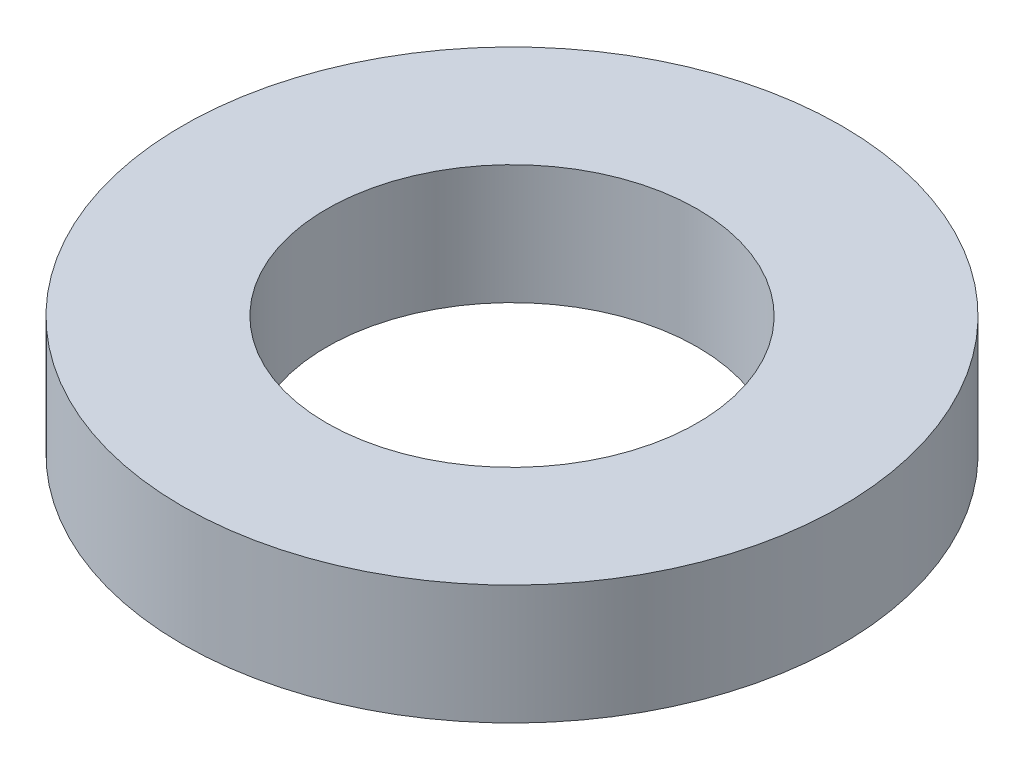
ISO-10303-21;
HEADER;
FILE_DESCRIPTION(('STEP AP214'),'2;1');
FILE_NAME('part.step','',(''),(''),'','','');
FILE_SCHEMA(('AUTOMOTIVE_DESIGN { 1 0 10303 214 1 1 1 1 }'));
ENDSEC;
DATA;
#1=APPLICATION_CONTEXT('core data for automotive mechanical design processes');
#2=APPLICATION_PROTOCOL_DEFINITION('international standard','automotive_design',2000,#1);
#3=PRODUCT_CONTEXT('',#1,'mechanical');
#4=PRODUCT('Part','Part','',(#3));
#5=PRODUCT_RELATED_PRODUCT_CATEGORY('part','',(#4));
#6=PRODUCT_DEFINITION_FORMATION('','',#4);
#7=PRODUCT_DEFINITION_CONTEXT('part definition',#1,'design');
#8=PRODUCT_DEFINITION('design','',#6,#7);
#9=PRODUCT_DEFINITION_SHAPE('','',#8);
#10=(LENGTH_UNIT() NAMED_UNIT(*) SI_UNIT(.MILLI.,.METRE.));
#11=(NAMED_UNIT(*) PLANE_ANGLE_UNIT() SI_UNIT($,.RADIAN.));
#12=(NAMED_UNIT(*) SI_UNIT($,.STERADIAN.) SOLID_ANGLE_UNIT());
#13=UNCERTAINTY_MEASURE_WITH_UNIT(LENGTH_MEASURE(1.E-05),#10,'distance_accuracy_value','');
#14=(GEOMETRIC_REPRESENTATION_CONTEXT(3) GLOBAL_UNCERTAINTY_ASSIGNED_CONTEXT((#13)) GLOBAL_UNIT_ASSIGNED_CONTEXT((#10,
#11,#12)) REPRESENTATION_CONTEXT('',''));
#15=CARTESIAN_POINT('',(0.,0.,0.));
#16=DIRECTION('',(0.,0.,1.));
#17=DIRECTION('',(1.,0.,0.));
#18=AXIS2_PLACEMENT_3D('',#15,#16,#17);
#19=CARTESIAN_POINT('',(0.,29.,0.));
#20=DIRECTION('',(0.,-1.,0.));
#21=DIRECTION('',(0.,0.,-1.));
#22=AXIS2_PLACEMENT_3D('',#19,#20,#21);
#23=CYLINDRICAL_SURFACE('',#22,80.);
#24=CARTESIAN_POINT('',(0.,29.,0.));
#25=DIRECTION('',(0.,1.,0.));
#26=DIRECTION('',(0.,0.,1.));
#27=AXIS2_PLACEMENT_3D('',#24,#25,#26);
#28=CIRCLE('',#27,80.);
#29=CARTESIAN_POINT('',(0.,29.,-80.));
#30=VERTEX_POINT('',#29);
#31=EDGE_CURVE('E10',#30,#30,#28,.T.);
#32=CARTESIAN_POINT('',(0.,0.,0.));
#33=DIRECTION('',(0.,1.,0.));
#34=DIRECTION('',(0.,0.,1.));
#35=AXIS2_PLACEMENT_3D('',#32,#33,#34);
#36=CIRCLE('',#35,80.);
#37=CARTESIAN_POINT('',(0.,0.,-80.));
#38=VERTEX_POINT('',#37);
#39=EDGE_CURVE('E37',#38,#38,#36,.T.);
#40=CARTESIAN_POINT('',(0.,29.,-80.));
#41=CARTESIAN_POINT('',(0.,28.6979166666667,-80.));
#42=CARTESIAN_POINT('',(0.,28.3958333333333,-80.));
#43=CARTESIAN_POINT('',(0.,27.7916666666667,-80.));
#44=CARTESIAN_POINT('',(0.,27.4895833333333,-80.));
#45=CARTESIAN_POINT('',(0.,26.8854166666667,-80.));
#46=CARTESIAN_POINT('',(0.,26.5833333333333,-80.));
#47=CARTESIAN_POINT('',(0.,25.9791666666667,-80.));
#48=CARTESIAN_POINT('',(0.,25.6770833333333,-80.));
#49=CARTESIAN_POINT('',(0.,25.0729166666667,-80.));
#50=CARTESIAN_POINT('',(0.,24.7708333333333,-80.));
#51=CARTESIAN_POINT('',(0.,24.1666666666667,-80.));
#52=CARTESIAN_POINT('',(0.,23.8645833333333,-80.));
#53=CARTESIAN_POINT('',(0.,23.2604166666667,-80.));
#54=CARTESIAN_POINT('',(0.,22.9583333333333,-80.));
#55=CARTESIAN_POINT('',(0.,22.3541666666667,-80.));
#56=CARTESIAN_POINT('',(0.,22.0520833333333,-80.));
#57=CARTESIAN_POINT('',(0.,21.4479166666667,-80.));
#58=CARTESIAN_POINT('',(0.,21.1458333333333,-80.));
#59=CARTESIAN_POINT('',(0.,20.5416666666667,-80.));
#60=CARTESIAN_POINT('',(0.,20.2395833333333,-80.));
#61=CARTESIAN_POINT('',(0.,19.6354166666667,-80.));
#62=CARTESIAN_POINT('',(0.,19.3333333333333,-80.));
#63=CARTESIAN_POINT('',(0.,18.7291666666667,-80.));
#64=CARTESIAN_POINT('',(0.,18.4270833333333,-80.));
#65=CARTESIAN_POINT('',(0.,17.8229166666667,-80.));
#66=CARTESIAN_POINT('',(0.,17.5208333333333,-80.));
#67=CARTESIAN_POINT('',(0.,16.9166666666667,-80.));
#68=CARTESIAN_POINT('',(0.,16.6145833333333,-80.));
#69=CARTESIAN_POINT('',(0.,16.0104166666667,-80.));
#70=CARTESIAN_POINT('',(0.,15.7083333333333,-80.));
#71=CARTESIAN_POINT('',(0.,15.1041666666667,-80.));
#72=CARTESIAN_POINT('',(0.,14.8020833333333,-80.));
#73=CARTESIAN_POINT('',(0.,14.1979166666667,-80.));
#74=CARTESIAN_POINT('',(0.,13.8958333333333,-80.));
#75=CARTESIAN_POINT('',(0.,13.2916666666667,-80.));
#76=CARTESIAN_POINT('',(0.,12.9895833333333,-80.));
#77=CARTESIAN_POINT('',(0.,12.3854166666667,-80.));
#78=CARTESIAN_POINT('',(0.,12.0833333333333,-80.));
#79=CARTESIAN_POINT('',(0.,11.4791666666667,-80.));
#80=CARTESIAN_POINT('',(0.,11.1770833333333,-80.));
#81=CARTESIAN_POINT('',(0.,10.5729166666667,-80.));
#82=CARTESIAN_POINT('',(0.,10.2708333333333,-80.));
#83=CARTESIAN_POINT('',(0.,9.66666666666667,-80.));
#84=CARTESIAN_POINT('',(0.,9.36458333333333,-80.));
#85=CARTESIAN_POINT('',(0.,8.76041666666667,-80.));
#86=CARTESIAN_POINT('',(0.,8.45833333333333,-80.));
#87=CARTESIAN_POINT('',(0.,7.85416666666667,-80.));
#88=CARTESIAN_POINT('',(0.,7.55208333333333,-80.));
#89=CARTESIAN_POINT('',(0.,6.94791666666667,-80.));
#90=CARTESIAN_POINT('',(0.,6.64583333333333,-80.));
#91=CARTESIAN_POINT('',(0.,6.04166666666667,-80.));
#92=CARTESIAN_POINT('',(0.,5.73958333333333,-80.));
#93=CARTESIAN_POINT('',(0.,5.13541666666667,-80.));
#94=CARTESIAN_POINT('',(0.,4.83333333333333,-80.));
#95=CARTESIAN_POINT('',(0.,4.22916666666667,-80.));
#96=CARTESIAN_POINT('',(0.,3.92708333333333,-80.));
#97=CARTESIAN_POINT('',(0.,3.32291666666667,-80.));
#98=CARTESIAN_POINT('',(0.,3.02083333333333,-80.));
#99=CARTESIAN_POINT('',(0.,2.41666666666667,-80.));
#100=CARTESIAN_POINT('',(0.,2.11458333333333,-80.));
#101=CARTESIAN_POINT('',(0.,1.51041666666667,-80.));
#102=CARTESIAN_POINT('',(0.,1.20833333333333,-80.));
#103=CARTESIAN_POINT('',(0.,0.604166666666667,-80.));
#104=CARTESIAN_POINT('',(0.,0.302083333333333,-80.));
#105=CARTESIAN_POINT('',(0.,0.,-80.));
#106=B_SPLINE_CURVE_WITH_KNOTS('',3,(#40,#41,#42,#43,#44,#45,#46,#47,#48,#49,#50,#51,#52,#53,
#54,#55,#56,#57,#58,#59,#60,#61,#62,#63,#64,#65,#66,#67,#68,#69,#70,#71,#72,#73,#74,#75,#76,#77,
#78,#79,#80,#81,#82,#83,#84,#85,#86,#87,#88,#89,#90,#91,#92,#93,#94,#95,#96,#97,#98,#99,#100,
#101,#102,#103,#104,#105),.UNSPECIFIED.,.F.,.F.,(4,2,2,2,2,2,2,2,2,2,2,2,2,2,2,2,2,2,2,2,2,2,2,
2,2,2,2,2,2,2,2,2,4),(0.,0.906249999999997,1.8125,2.71875,3.625,4.53125,5.4375,6.34375,7.25,
8.15625,9.0625,9.96875,10.875,11.78125,12.6875,13.59375,14.5,15.40625,16.3125,17.21875,18.125,
19.03125,19.9375,20.84375,21.75,22.65625,23.5625,24.46875,25.375,26.28125,27.1875,28.09375,29.),.UNSPECIFIED.);
#107=EDGE_CURVE('BSEAM40',#30,#38,#106,.T.);
#108=ORIENTED_EDGE('',*,*,#31,.F.);
#109=ORIENTED_EDGE('',*,*,#39,.T.);
#110=ORIENTED_EDGE('',*,*,#107,.T.);
#111=ORIENTED_EDGE('',*,*,#107,.F.);
#112=EDGE_LOOP('',(#108,#110,#109,#111));
#113=FACE_BOUND('',#112,.T.);
#114=ADVANCED_FACE('F40',(#113),#23,.T.);
#115=CARTESIAN_POINT('',(0.,29.,0.));
#116=DIRECTION('',(0.,1.,0.));
#117=DIRECTION('',(0.,0.,1.));
#118=AXIS2_PLACEMENT_3D('',#115,#116,#117);
#119=PLANE('',#118);
#120=CARTESIAN_POINT('',(0.,29.,0.));
#121=DIRECTION('',(0.,1.,0.));
#122=DIRECTION('',(0.,0.,1.));
#123=AXIS2_PLACEMENT_3D('',#120,#121,#122);
#124=CIRCLE('',#123,45.);
#125=CARTESIAN_POINT('',(0.,29.,-45.));
#126=VERTEX_POINT('',#125);
#127=EDGE_CURVE('E50',#126,#126,#124,.T.);
#128=ORIENTED_EDGE('',*,*,#127,.F.);
#129=EDGE_LOOP('',(#128));
#130=FACE_BOUND('',#129,.T.);
#131=ORIENTED_EDGE('',*,*,#31,.T.);
#132=EDGE_LOOP('',(#131));
#133=FACE_BOUND('',#132,.T.);
#134=ADVANCED_FACE('F59',(#130,#133),#119,.T.);
#135=CARTESIAN_POINT('',(0.,0.,0.));
#136=DIRECTION('',(0.,1.,0.));
#137=DIRECTION('',(0.,0.,1.));
#138=AXIS2_PLACEMENT_3D('',#135,#136,#137);
#139=PLANE('',#138);
#140=CARTESIAN_POINT('',(0.,0.,0.));
#141=DIRECTION('',(0.,1.,0.));
#142=DIRECTION('',(0.,0.,1.));
#143=AXIS2_PLACEMENT_3D('',#140,#141,#142);
#144=CIRCLE('',#143,45.);
#145=CARTESIAN_POINT('',(0.,0.,-45.));
#146=VERTEX_POINT('',#145);
#147=EDGE_CURVE('E47',#146,#146,#144,.T.);
#148=ORIENTED_EDGE('',*,*,#147,.T.);
#149=EDGE_LOOP('',(#148));
#150=FACE_BOUND('',#149,.T.);
#151=ORIENTED_EDGE('',*,*,#39,.F.);
#152=EDGE_LOOP('',(#151));
#153=FACE_BOUND('',#152,.T.);
#154=ADVANCED_FACE('F58',(#150,#153),#139,.F.);
#155=CARTESIAN_POINT('',(0.,29.,0.));
#156=DIRECTION('',(0.,-1.,0.));
#157=DIRECTION('',(0.,0.,-1.));
#158=AXIS2_PLACEMENT_3D('',#155,#156,#157);
#159=CYLINDRICAL_SURFACE('',#158,45.);
#160=CARTESIAN_POINT('',(0.,29.,-45.));
#161=CARTESIAN_POINT('',(0.,28.6979166666667,-45.));
#162=CARTESIAN_POINT('',(0.,28.3958333333333,-45.));
#163=CARTESIAN_POINT('',(0.,27.7916666666667,-45.));
#164=CARTESIAN_POINT('',(0.,27.4895833333333,-45.));
#165=CARTESIAN_POINT('',(0.,26.8854166666667,-45.));
#166=CARTESIAN_POINT('',(0.,26.5833333333333,-45.));
#167=CARTESIAN_POINT('',(0.,25.9791666666667,-45.));
#168=CARTESIAN_POINT('',(0.,25.6770833333333,-45.));
#169=CARTESIAN_POINT('',(0.,25.0729166666667,-45.));
#170=CARTESIAN_POINT('',(0.,24.7708333333333,-45.));
#171=CARTESIAN_POINT('',(0.,24.1666666666667,-45.));
#172=CARTESIAN_POINT('',(0.,23.8645833333333,-45.));
#173=CARTESIAN_POINT('',(0.,23.2604166666667,-45.));
#174=CARTESIAN_POINT('',(0.,22.9583333333333,-45.));
#175=CARTESIAN_POINT('',(0.,22.3541666666667,-45.));
#176=CARTESIAN_POINT('',(0.,22.0520833333333,-45.));
#177=CARTESIAN_POINT('',(0.,21.4479166666667,-45.));
#178=CARTESIAN_POINT('',(0.,21.1458333333333,-45.));
#179=CARTESIAN_POINT('',(0.,20.5416666666667,-45.));
#180=CARTESIAN_POINT('',(0.,20.2395833333333,-45.));
#181=CARTESIAN_POINT('',(0.,19.6354166666667,-45.));
#182=CARTESIAN_POINT('',(0.,19.3333333333333,-45.));
#183=CARTESIAN_POINT('',(0.,18.7291666666667,-45.));
#184=CARTESIAN_POINT('',(0.,18.4270833333333,-45.));
#185=CARTESIAN_POINT('',(0.,17.8229166666667,-45.));
#186=CARTESIAN_POINT('',(0.,17.5208333333333,-45.));
#187=CARTESIAN_POINT('',(0.,16.9166666666667,-45.));
#188=CARTESIAN_POINT('',(0.,16.6145833333333,-45.));
#189=CARTESIAN_POINT('',(0.,16.0104166666667,-45.));
#190=CARTESIAN_POINT('',(0.,15.7083333333333,-45.));
#191=CARTESIAN_POINT('',(0.,15.1041666666667,-45.));
#192=CARTESIAN_POINT('',(0.,14.8020833333333,-45.));
#193=CARTESIAN_POINT('',(0.,14.1979166666667,-45.));
#194=CARTESIAN_POINT('',(0.,13.8958333333333,-45.));
#195=CARTESIAN_POINT('',(0.,13.2916666666667,-45.));
#196=CARTESIAN_POINT('',(0.,12.9895833333333,-45.));
#197=CARTESIAN_POINT('',(0.,12.3854166666667,-45.));
#198=CARTESIAN_POINT('',(0.,12.0833333333333,-45.));
#199=CARTESIAN_POINT('',(0.,11.4791666666667,-45.));
#200=CARTESIAN_POINT('',(0.,11.1770833333333,-45.));
#201=CARTESIAN_POINT('',(0.,10.5729166666667,-45.));
#202=CARTESIAN_POINT('',(0.,10.2708333333333,-45.));
#203=CARTESIAN_POINT('',(0.,9.66666666666667,-45.));
#204=CARTESIAN_POINT('',(0.,9.36458333333333,-45.));
#205=CARTESIAN_POINT('',(0.,8.76041666666667,-45.));
#206=CARTESIAN_POINT('',(0.,8.45833333333333,-45.));
#207=CARTESIAN_POINT('',(0.,7.85416666666667,-45.));
#208=CARTESIAN_POINT('',(0.,7.55208333333333,-45.));
#209=CARTESIAN_POINT('',(0.,6.94791666666667,-45.));
#210=CARTESIAN_POINT('',(0.,6.64583333333333,-45.));
#211=CARTESIAN_POINT('',(0.,6.04166666666667,-45.));
#212=CARTESIAN_POINT('',(0.,5.73958333333333,-45.));
#213=CARTESIAN_POINT('',(0.,5.13541666666667,-45.));
#214=CARTESIAN_POINT('',(0.,4.83333333333333,-45.));
#215=CARTESIAN_POINT('',(0.,4.22916666666667,-45.));
#216=CARTESIAN_POINT('',(0.,3.92708333333333,-45.));
#217=CARTESIAN_POINT('',(0.,3.32291666666667,-45.));
#218=CARTESIAN_POINT('',(0.,3.02083333333333,-45.));
#219=CARTESIAN_POINT('',(0.,2.41666666666667,-45.));
#220=CARTESIAN_POINT('',(0.,2.11458333333333,-45.));
#221=CARTESIAN_POINT('',(0.,1.51041666666667,-45.));
#222=CARTESIAN_POINT('',(0.,1.20833333333333,-45.));
#223=CARTESIAN_POINT('',(0.,0.604166666666667,-45.));
#224=CARTESIAN_POINT('',(0.,0.302083333333333,-45.));
#225=CARTESIAN_POINT('',(0.,0.,-45.));
#226=B_SPLINE_CURVE_WITH_KNOTS('',3,(#160,#161,#162,#163,#164,#165,#166,#167,#168,#169,#170,
#171,#172,#173,#174,#175,#176,#177,#178,#179,#180,#181,#182,#183,#184,#185,#186,#187,#188,#189,
#190,#191,#192,#193,#194,#195,#196,#197,#198,#199,#200,#201,#202,#203,#204,#205,#206,#207,#208,
#209,#210,#211,#212,#213,#214,#215,#216,#217,#218,#219,#220,#221,#222,#223,#224,#225),
.UNSPECIFIED.,.F.,.F.,(4,2,2,2,2,2,2,2,2,2,2,2,2,2,2,2,2,2,2,2,2,2,2,2,2,2,2,2,2,2,2,2,4),(0.,
0.906249999999997,1.8125,2.71875,3.625,4.53125,5.4375,6.34375,7.25,8.15625,9.0625,9.96875,
10.875,11.78125,12.6875,13.59375,14.5,15.40625,16.3125,17.21875,18.125,19.03125,19.9375,
20.84375,21.75,22.65625,23.5625,24.46875,25.375,26.28125,27.1875,28.09375,29.),.UNSPECIFIED.);
#227=EDGE_CURVE('BSEAM54',#126,#146,#226,.T.);
#228=ORIENTED_EDGE('',*,*,#127,.T.);
#229=ORIENTED_EDGE('',*,*,#147,.F.);
#230=ORIENTED_EDGE('',*,*,#227,.T.);
#231=ORIENTED_EDGE('',*,*,#227,.F.);
#232=EDGE_LOOP('',(#228,#230,#229,#231));
#233=FACE_BOUND('',#232,.T.);
#234=ADVANCED_FACE('F54',(#233),#159,.F.);
#235=CLOSED_SHELL('',(#114,#134,#154,#234));
#236=MANIFOLD_SOLID_BREP('B2',#235);
#237=ADVANCED_BREP_SHAPE_REPRESENTATION('',(#18,#236),#14);
#238=SHAPE_DEFINITION_REPRESENTATION(#9,#237);
ENDSEC;
END-ISO-10303-21;
